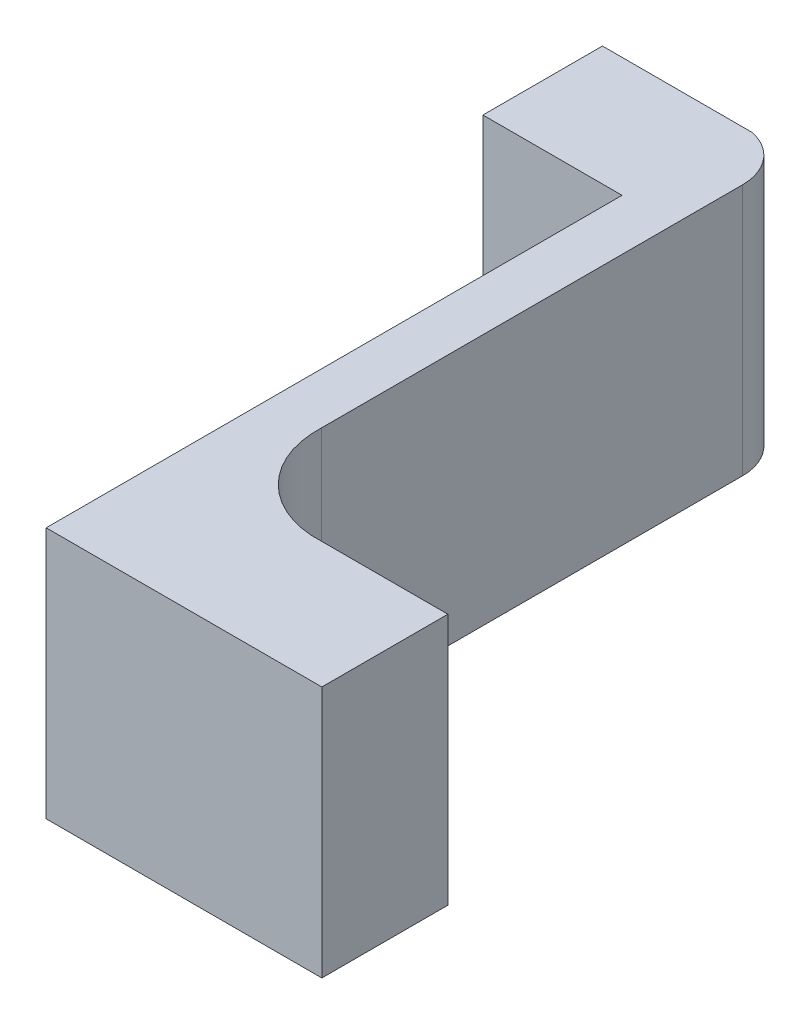
ISO-10303-21;
HEADER;
FILE_DESCRIPTION(('STEP AP214'),'2;1');
FILE_NAME('part.step','',(''),(''),'','','');
FILE_SCHEMA(('AUTOMOTIVE_DESIGN { 1 0 10303 214 1 1 1 1 }'));
ENDSEC;
DATA;
#1=APPLICATION_CONTEXT('core data for automotive mechanical design processes');
#2=APPLICATION_PROTOCOL_DEFINITION('international standard','automotive_design',2000,#1);
#3=PRODUCT_CONTEXT('',#1,'mechanical');
#4=PRODUCT('Part','Part','',(#3));
#5=PRODUCT_RELATED_PRODUCT_CATEGORY('part','',(#4));
#6=PRODUCT_DEFINITION_FORMATION('','',#4);
#7=PRODUCT_DEFINITION_CONTEXT('part definition',#1,'design');
#8=PRODUCT_DEFINITION('design','',#6,#7);
#9=PRODUCT_DEFINITION_SHAPE('','',#8);
#10=(LENGTH_UNIT() NAMED_UNIT(*) SI_UNIT(.MILLI.,.METRE.));
#11=(NAMED_UNIT(*) PLANE_ANGLE_UNIT() SI_UNIT($,.RADIAN.));
#12=(NAMED_UNIT(*) SI_UNIT($,.STERADIAN.) SOLID_ANGLE_UNIT());
#13=UNCERTAINTY_MEASURE_WITH_UNIT(LENGTH_MEASURE(1.E-05),#10,'distance_accuracy_value','');
#14=(GEOMETRIC_REPRESENTATION_CONTEXT(3) GLOBAL_UNCERTAINTY_ASSIGNED_CONTEXT((#13)) GLOBAL_UNIT_ASSIGNED_CONTEXT((#10,
#11,#12)) REPRESENTATION_CONTEXT('',''));
#15=CARTESIAN_POINT('',(0.,0.,0.));
#16=DIRECTION('',(0.,0.,1.));
#17=DIRECTION('',(1.,0.,0.));
#18=AXIS2_PLACEMENT_3D('',#15,#16,#17);
#19=CARTESIAN_POINT('',(0.0226522135703363,0.4,0.));
#20=DIRECTION('',(-1.,0.,0.));
#21=DIRECTION('',(0.,0.,1.));
#22=AXIS2_PLACEMENT_3D('',#19,#20,#21);
#23=PLANE('',#22);
#24=DIRECTION('',(0.,0.,-1.));
#25=VECTOR('',#24,1.);
#26=CARTESIAN_POINT('',(0.0226522135703363,0.,0.));
#27=LINE('',#26,#25);
#28=CARTESIAN_POINT('',(0.0226522135703363,0.,0.884366244887887));
#29=VERTEX_POINT('',#28);
#30=CARTESIAN_POINT('',(0.0226522135703363,0.,0.215915587273856));
#31=VERTEX_POINT('',#30);
#32=EDGE_CURVE('E155',#29,#31,#27,.T.);
#33=ORIENTED_EDGE('',*,*,#32,.T.);
#34=DIRECTION('',(0.,-1.,0.));
#35=VECTOR('',#34,1.);
#36=CARTESIAN_POINT('',(0.0226522135703363,0.4,0.215915587273856));
#37=LINE('',#36,#35);
#38=CARTESIAN_POINT('',(0.0226522135703363,0.4,0.215915587273856));
#39=VERTEX_POINT('',#38);
#40=EDGE_CURVE('E11',#39,#31,#37,.T.);
#41=ORIENTED_EDGE('',*,*,#40,.F.);
#42=DIRECTION('',(0.,0.,-1.));
#43=VECTOR('',#42,1.);
#44=CARTESIAN_POINT('',(0.0226522135703363,0.4,0.));
#45=LINE('',#44,#43);
#46=CARTESIAN_POINT('',(0.0226522135703363,0.4,0.884366244887887));
#47=VERTEX_POINT('',#46);
#48=EDGE_CURVE('E189',#47,#39,#45,.T.);
#49=ORIENTED_EDGE('',*,*,#48,.F.);
#50=DIRECTION('',(0.,-1.,0.));
#51=VECTOR('',#50,1.);
#52=CARTESIAN_POINT('',(0.0226522135703363,0.4,0.884366244887887));
#53=LINE('',#52,#51);
#54=EDGE_CURVE('E58',#47,#29,#53,.T.);
#55=ORIENTED_EDGE('',*,*,#54,.T.);
#56=EDGE_LOOP('',(#33,#41,#49,#55));
#57=FACE_BOUND('',#56,.T.);
#58=ADVANCED_FACE('F41',(#57),#23,.F.);
#59=CARTESIAN_POINT('',(-0.058509075107323,0.4,0.215915587273856));
#60=DIRECTION('',(0.,-1.,0.));
#61=DIRECTION('',(0.,0.,-1.));
#62=AXIS2_PLACEMENT_3D('',#59,#60,#61);
#63=CYLINDRICAL_SURFACE('',#62,0.0811612886776593);
#64=CARTESIAN_POINT('',(-0.058509075107323,0.,0.215915587273856));
#65=DIRECTION('',(0.,1.,0.));
#66=DIRECTION('',(0.,0.,1.));
#67=AXIS2_PLACEMENT_3D('',#64,#65,#66);
#68=CIRCLE('',#67,0.0811612886776593);
#69=CARTESIAN_POINT('',(-0.0412483316049303,0.,0.136610975090434));
#70=VERTEX_POINT('',#69);
#71=EDGE_CURVE('E158',#31,#70,#68,.T.);
#72=ORIENTED_EDGE('',*,*,#71,.T.);
#73=DIRECTION('',(0.,-1.,0.));
#74=VECTOR('',#73,1.);
#75=CARTESIAN_POINT('',(-0.0412483316049303,0.4,0.136610975090434));
#76=LINE('',#75,#74);
#77=CARTESIAN_POINT('',(-0.0412483316049303,0.4,0.136610975090434));
#78=VERTEX_POINT('',#77);
#79=EDGE_CURVE('E50',#78,#70,#76,.T.);
#80=ORIENTED_EDGE('',*,*,#79,.F.);
#81=CARTESIAN_POINT('',(-0.058509075107323,0.4,0.215915587273856));
#82=DIRECTION('',(0.,1.,0.));
#83=DIRECTION('',(0.,0.,1.));
#84=AXIS2_PLACEMENT_3D('',#81,#82,#83);
#85=CIRCLE('',#84,0.0811612886776593);
#86=EDGE_CURVE('E102',#39,#78,#85,.T.);
#87=ORIENTED_EDGE('',*,*,#86,.F.);
#88=ORIENTED_EDGE('',*,*,#40,.T.);
#89=EDGE_LOOP('',(#72,#80,#87,#88));
#90=FACE_BOUND('',#89,.T.);
#91=ADVANCED_FACE('F215',(#90),#63,.T.);
#92=CARTESIAN_POINT('',(0.,0.4,0.136610975090434));
#93=DIRECTION('',(0.,0.,-1.));
#94=DIRECTION('',(-1.,0.,0.));
#95=AXIS2_PLACEMENT_3D('',#92,#93,#94);
#96=PLANE('',#95);
#97=DIRECTION('',(1.,0.,0.));
#98=VECTOR('',#97,1.);
#99=CARTESIAN_POINT('',(0.,0.,0.136610975090434));
#100=LINE('',#99,#98);
#101=CARTESIAN_POINT('',(-0.279282768687494,0.,0.136610975090434));
#102=VERTEX_POINT('',#101);
#103=EDGE_CURVE('E162',#102,#70,#100,.T.);
#104=ORIENTED_EDGE('',*,*,#103,.F.);
#105=DIRECTION('',(0.,-1.,0.));
#106=VECTOR('',#105,1.);
#107=CARTESIAN_POINT('',(-0.279282768687494,0.4,0.136610975090434));
#108=LINE('',#107,#106);
#109=CARTESIAN_POINT('',(-0.279282768687494,0.4,0.136610975090434));
#110=VERTEX_POINT('',#109);
#111=EDGE_CURVE('E206',#110,#102,#108,.T.);
#112=ORIENTED_EDGE('',*,*,#111,.F.);
#113=DIRECTION('',(1.,0.,0.));
#114=VECTOR('',#113,1.);
#115=CARTESIAN_POINT('',(0.,0.4,0.136610975090434));
#116=LINE('',#115,#114);
#117=EDGE_CURVE('E214',#110,#78,#116,.T.);
#118=ORIENTED_EDGE('',*,*,#117,.T.);
#119=ORIENTED_EDGE('',*,*,#79,.T.);
#120=EDGE_LOOP('',(#104,#112,#118,#119));
#121=FACE_BOUND('',#120,.T.);
#122=ADVANCED_FACE('F212',(#121),#96,.T.);
#123=CARTESIAN_POINT('',(-0.279282768687494,0.4,0.));
#124=DIRECTION('',(-1.,0.,0.));
#125=DIRECTION('',(0.,0.,1.));
#126=AXIS2_PLACEMENT_3D('',#123,#124,#125);
#127=PLANE('',#126);
#128=DIRECTION('',(0.,0.,-1.));
#129=VECTOR('',#128,1.);
#130=CARTESIAN_POINT('',(-0.279282768687494,0.,0.));
#131=LINE('',#130,#129);
#132=CARTESIAN_POINT('',(-0.279282768687494,0.,0.326283695272878));
#133=VERTEX_POINT('',#132);
#134=EDGE_CURVE('E166',#133,#102,#131,.T.);
#135=ORIENTED_EDGE('',*,*,#134,.F.);
#136=DIRECTION('',(0.,-1.,0.));
#137=VECTOR('',#136,1.);
#138=CARTESIAN_POINT('',(-0.279282768687494,0.4,0.326283695272878));
#139=LINE('',#138,#137);
#140=CARTESIAN_POINT('',(-0.279282768687494,0.4,0.326283695272878));
#141=VERTEX_POINT('',#140);
#142=EDGE_CURVE('E203',#141,#133,#139,.T.);
#143=ORIENTED_EDGE('',*,*,#142,.F.);
#144=DIRECTION('',(0.,0.,-1.));
#145=VECTOR('',#144,1.);
#146=CARTESIAN_POINT('',(-0.279282768687494,0.4,0.));
#147=LINE('',#146,#145);
#148=EDGE_CURVE('E226',#141,#110,#147,.T.);
#149=ORIENTED_EDGE('',*,*,#148,.T.);
#150=ORIENTED_EDGE('',*,*,#111,.T.);
#151=EDGE_LOOP('',(#135,#143,#149,#150));
#152=FACE_BOUND('',#151,.T.);
#153=ADVANCED_FACE('F223',(#152),#127,.T.);
#154=CARTESIAN_POINT('',(0.,0.4,0.326283695272878));
#155=DIRECTION('',(0.,0.,1.));
#156=DIRECTION('',(1.,0.,0.));
#157=AXIS2_PLACEMENT_3D('',#154,#155,#156);
#158=PLANE('',#157);
#159=DIRECTION('',(-1.,0.,0.));
#160=VECTOR('',#159,1.);
#161=CARTESIAN_POINT('',(0.,0.,0.326283695272878));
#162=LINE('',#161,#160);
#163=CARTESIAN_POINT('',(-0.058509075107323,0.,0.326283695272878));
#164=VERTEX_POINT('',#163);
#165=EDGE_CURVE('E170',#164,#133,#162,.T.);
#166=ORIENTED_EDGE('',*,*,#165,.F.);
#167=DIRECTION('',(0.,-1.,0.));
#168=VECTOR('',#167,1.);
#169=CARTESIAN_POINT('',(-0.058509075107323,0.4,0.326283695272878));
#170=LINE('',#169,#168);
#171=CARTESIAN_POINT('',(-0.058509075107323,0.4,0.326283695272878));
#172=VERTEX_POINT('',#171);
#173=EDGE_CURVE('E200',#172,#164,#170,.T.);
#174=ORIENTED_EDGE('',*,*,#173,.F.);
#175=DIRECTION('',(-1.,0.,0.));
#176=VECTOR('',#175,1.);
#177=CARTESIAN_POINT('',(0.,0.4,0.326283695272878));
#178=LINE('',#177,#176);
#179=EDGE_CURVE('E233',#172,#141,#178,.T.);
#180=ORIENTED_EDGE('',*,*,#179,.T.);
#181=ORIENTED_EDGE('',*,*,#142,.T.);
#182=EDGE_LOOP('',(#166,#174,#180,#181));
#183=FACE_BOUND('',#182,.T.);
#184=ADVANCED_FACE('F272',(#183),#158,.T.);
#185=CARTESIAN_POINT('',(-0.058509075107323,0.4,0.));
#186=DIRECTION('',(1.,0.,0.));
#187=DIRECTION('',(0.,0.,-1.));
#188=AXIS2_PLACEMENT_3D('',#185,#186,#187);
#189=PLANE('',#188);
#190=DIRECTION('',(0.,0.,1.));
#191=VECTOR('',#190,1.);
#192=CARTESIAN_POINT('',(-0.058509075107323,0.,0.));
#193=LINE('',#192,#191);
#194=CARTESIAN_POINT('',(-0.058509075107323,0.,1.24020398134618));
#195=VERTEX_POINT('',#194);
#196=EDGE_CURVE('E174',#164,#195,#193,.T.);
#197=ORIENTED_EDGE('',*,*,#196,.T.);
#198=DIRECTION('',(0.,-1.,0.));
#199=VECTOR('',#198,1.);
#200=CARTESIAN_POINT('',(-0.058509075107323,0.4,1.24020398134618));
#201=LINE('',#200,#199);
#202=CARTESIAN_POINT('',(-0.058509075107323,0.4,1.24020398134618));
#203=VERTEX_POINT('',#202);
#204=EDGE_CURVE('E196',#203,#195,#201,.T.);
#205=ORIENTED_EDGE('',*,*,#204,.F.);
#206=DIRECTION('',(0.,0.,1.));
#207=VECTOR('',#206,1.);
#208=CARTESIAN_POINT('',(-0.058509075107323,0.4,0.));
#209=LINE('',#208,#207);
#210=EDGE_CURVE('E240',#172,#203,#209,.T.);
#211=ORIENTED_EDGE('',*,*,#210,.F.);
#212=ORIENTED_EDGE('',*,*,#173,.T.);
#213=EDGE_LOOP('',(#197,#205,#211,#212));
#214=FACE_BOUND('',#213,.T.);
#215=ADVANCED_FACE('F246',(#214),#189,.F.);
#216=CARTESIAN_POINT('',(0.,0.4,1.24020398134618));
#217=DIRECTION('',(0.,0.,-1.));
#218=DIRECTION('',(-1.,0.,0.));
#219=AXIS2_PLACEMENT_3D('',#216,#217,#218);
#220=PLANE('',#219);
#221=DIRECTION('',(1.,0.,0.));
#222=VECTOR('',#221,1.);
#223=CARTESIAN_POINT('',(0.,0.,1.24020398134618));
#224=LINE('',#223,#222);
#225=CARTESIAN_POINT('',(0.37899795820806,0.,1.24020398134618));
#226=VERTEX_POINT('',#225);
#227=EDGE_CURVE('E177',#195,#226,#224,.T.);
#228=ORIENTED_EDGE('',*,*,#227,.T.);
#229=DIRECTION('',(0.,-1.,0.));
#230=VECTOR('',#229,1.);
#231=CARTESIAN_POINT('',(0.37899795820806,0.4,1.24020398134618));
#232=LINE('',#231,#230);
#233=CARTESIAN_POINT('',(0.37899795820806,0.4,1.24020398134618));
#234=VERTEX_POINT('',#233);
#235=EDGE_CURVE('E145',#234,#226,#232,.T.);
#236=ORIENTED_EDGE('',*,*,#235,.F.);
#237=DIRECTION('',(1.,0.,0.));
#238=VECTOR('',#237,1.);
#239=CARTESIAN_POINT('',(0.,0.4,1.24020398134618));
#240=LINE('',#239,#238);
#241=EDGE_CURVE('E131',#203,#234,#240,.T.);
#242=ORIENTED_EDGE('',*,*,#241,.F.);
#243=ORIENTED_EDGE('',*,*,#204,.T.);
#244=EDGE_LOOP('',(#228,#236,#242,#243));
#245=FACE_BOUND('',#244,.T.);
#246=ADVANCED_FACE('F249',(#245),#220,.F.);
#247=CARTESIAN_POINT('',(0.37899795820806,0.4,0.));
#248=DIRECTION('',(-1.,0.,0.));
#249=DIRECTION('',(0.,0.,1.));
#250=AXIS2_PLACEMENT_3D('',#247,#248,#249);
#251=PLANE('',#250);
#252=DIRECTION('',(0.,0.,-1.));
#253=VECTOR('',#252,1.);
#254=CARTESIAN_POINT('',(0.37899795820806,0.,0.));
#255=LINE('',#254,#253);
#256=CARTESIAN_POINT('',(0.37899795820806,0.,1.04020398134618));
#257=VERTEX_POINT('',#256);
#258=EDGE_CURVE('E141',#226,#257,#255,.T.);
#259=ORIENTED_EDGE('',*,*,#258,.T.);
#260=DIRECTION('',(0.,-1.,0.));
#261=VECTOR('',#260,1.);
#262=CARTESIAN_POINT('',(0.37899795820806,0.4,1.04020398134618));
#263=LINE('',#262,#261);
#264=CARTESIAN_POINT('',(0.37899795820806,0.4,1.04020398134618));
#265=VERTEX_POINT('',#264);
#266=EDGE_CURVE('E138',#265,#257,#263,.T.);
#267=ORIENTED_EDGE('',*,*,#266,.F.);
#268=DIRECTION('',(0.,0.,-1.));
#269=VECTOR('',#268,1.);
#270=CARTESIAN_POINT('',(0.37899795820806,0.4,0.));
#271=LINE('',#270,#269);
#272=EDGE_CURVE('E124',#234,#265,#271,.T.);
#273=ORIENTED_EDGE('',*,*,#272,.F.);
#274=ORIENTED_EDGE('',*,*,#235,.T.);
#275=EDGE_LOOP('',(#259,#267,#273,#274));
#276=FACE_BOUND('',#275,.T.);
#277=ADVANCED_FACE('F139',(#276),#251,.F.);
#278=CARTESIAN_POINT('',(0.,0.4,1.04020398134618));
#279=DIRECTION('',(0.,0.,-1.));
#280=DIRECTION('',(-1.,0.,0.));
#281=AXIS2_PLACEMENT_3D('',#278,#279,#280);
#282=PLANE('',#281);
#283=DIRECTION('',(1.,0.,0.));
#284=VECTOR('',#283,1.);
#285=CARTESIAN_POINT('',(0.,0.,1.04020398134618));
#286=LINE('',#285,#284);
#287=CARTESIAN_POINT('',(0.162867241332102,0.,1.04020398134618));
#288=VERTEX_POINT('',#287);
#289=EDGE_CURVE('E182',#288,#257,#286,.T.);
#290=ORIENTED_EDGE('',*,*,#289,.F.);
#291=DIRECTION('',(0.,-1.,0.));
#292=VECTOR('',#291,1.);
#293=CARTESIAN_POINT('',(0.162867241332102,0.4,1.04020398134618));
#294=LINE('',#293,#292);
#295=CARTESIAN_POINT('',(0.162867241332102,0.4,1.04020398134618));
#296=VERTEX_POINT('',#295);
#297=EDGE_CURVE('E90',#296,#288,#294,.T.);
#298=ORIENTED_EDGE('',*,*,#297,.F.);
#299=DIRECTION('',(1.,0.,0.));
#300=VECTOR('',#299,1.);
#301=CARTESIAN_POINT('',(0.,0.4,1.04020398134618));
#302=LINE('',#301,#300);
#303=EDGE_CURVE('E129',#296,#265,#302,.T.);
#304=ORIENTED_EDGE('',*,*,#303,.T.);
#305=ORIENTED_EDGE('',*,*,#266,.T.);
#306=EDGE_LOOP('',(#290,#298,#304,#305));
#307=FACE_BOUND('',#306,.T.);
#308=ADVANCED_FACE('F147',(#307),#282,.T.);
#309=CARTESIAN_POINT('',(0.172017678475591,0.4,0.890972759281621));
#310=DIRECTION('',(0.,-1.,0.));
#311=DIRECTION('',(0.,0.,-1.));
#312=AXIS2_PLACEMENT_3D('',#309,#310,#311);
#313=CYLINDRICAL_SURFACE('',#312,0.149511498349784);
#314=CARTESIAN_POINT('',(0.172017678475591,0.,0.890972759281621));
#315=DIRECTION('',(0.,1.,0.));
#316=DIRECTION('',(0.,0.,1.));
#317=AXIS2_PLACEMENT_3D('',#314,#315,#316);
#318=CIRCLE('',#317,0.149511498349784);
#319=EDGE_CURVE('E185',#29,#288,#318,.T.);
#320=ORIENTED_EDGE('',*,*,#319,.F.);
#321=ORIENTED_EDGE('',*,*,#54,.F.);
#322=CARTESIAN_POINT('',(0.172017678475591,0.4,0.890972759281621));
#323=DIRECTION('',(0.,1.,0.));
#324=DIRECTION('',(0.,0.,1.));
#325=AXIS2_PLACEMENT_3D('',#322,#323,#324);
#326=CIRCLE('',#325,0.149511498349784);
#327=EDGE_CURVE('E149',#47,#296,#326,.T.);
#328=ORIENTED_EDGE('',*,*,#327,.T.);
#329=ORIENTED_EDGE('',*,*,#297,.T.);
#330=EDGE_LOOP('',(#320,#321,#328,#329));
#331=FACE_BOUND('',#330,.T.);
#332=ADVANCED_FACE('F250',(#331),#313,.F.);
#333=CARTESIAN_POINT('',(0.,0.4,0.));
#334=DIRECTION('',(0.,1.,0.));
#335=DIRECTION('',(0.,0.,1.));
#336=AXIS2_PLACEMENT_3D('',#333,#334,#335);
#337=PLANE('',#336);
#338=ORIENTED_EDGE('',*,*,#48,.T.);
#339=ORIENTED_EDGE('',*,*,#86,.T.);
#340=ORIENTED_EDGE('',*,*,#117,.F.);
#341=ORIENTED_EDGE('',*,*,#148,.F.);
#342=ORIENTED_EDGE('',*,*,#179,.F.);
#343=ORIENTED_EDGE('',*,*,#210,.T.);
#344=ORIENTED_EDGE('',*,*,#241,.T.);
#345=ORIENTED_EDGE('',*,*,#272,.T.);
#346=ORIENTED_EDGE('',*,*,#303,.F.);
#347=ORIENTED_EDGE('',*,*,#327,.F.);
#348=EDGE_LOOP('',(#338,#339,#340,#341,#342,#343,#344,#345,#346,#347));
#349=FACE_BOUND('',#348,.T.);
#350=ADVANCED_FACE('F126',(#349),#337,.T.);
#351=CARTESIAN_POINT('',(0.,0.,0.));
#352=DIRECTION('',(0.,1.,0.));
#353=DIRECTION('',(0.,0.,1.));
#354=AXIS2_PLACEMENT_3D('',#351,#352,#353);
#355=PLANE('',#354);
#356=ORIENTED_EDGE('',*,*,#32,.F.);
#357=ORIENTED_EDGE('',*,*,#319,.T.);
#358=ORIENTED_EDGE('',*,*,#289,.T.);
#359=ORIENTED_EDGE('',*,*,#258,.F.);
#360=ORIENTED_EDGE('',*,*,#227,.F.);
#361=ORIENTED_EDGE('',*,*,#196,.F.);
#362=ORIENTED_EDGE('',*,*,#165,.T.);
#363=ORIENTED_EDGE('',*,*,#134,.T.);
#364=ORIENTED_EDGE('',*,*,#103,.T.);
#365=ORIENTED_EDGE('',*,*,#71,.F.);
#366=EDGE_LOOP('',(#356,#357,#358,#359,#360,#361,#362,#363,#364,#365));
#367=FACE_BOUND('',#366,.T.);
#368=ADVANCED_FACE('F218',(#367),#355,.F.);
#369=CLOSED_SHELL('',(#58,#91,#122,#153,#184,#215,#246,#277,#308,#332,#350,#368));
#370=MANIFOLD_SOLID_BREP('B2',#369);
#371=ADVANCED_BREP_SHAPE_REPRESENTATION('',(#18,#370),#14);
#372=SHAPE_DEFINITION_REPRESENTATION(#9,#371);
ENDSEC;
END-ISO-10303-21;
